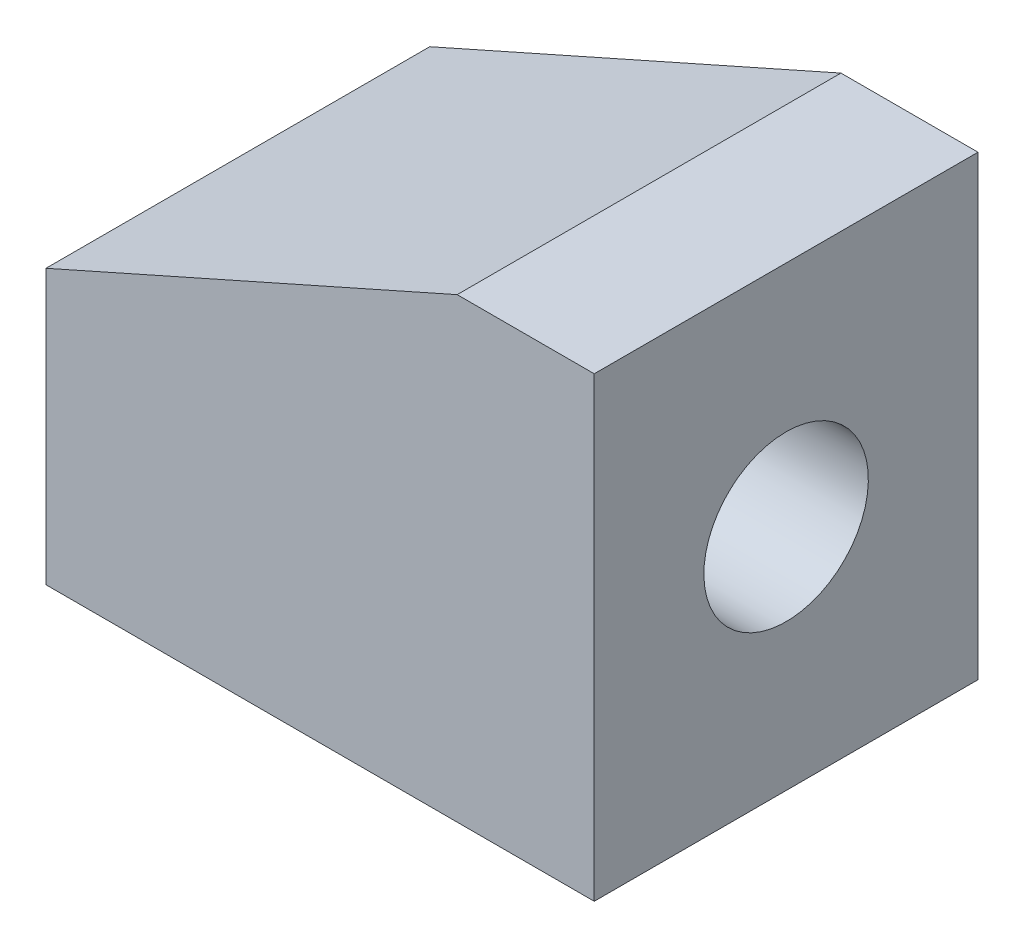
ISO-10303-21;
HEADER;
FILE_DESCRIPTION(('STEP AP214'),'2;1');
FILE_NAME('part.step','',(''),(''),'','','');
FILE_SCHEMA(('AUTOMOTIVE_DESIGN { 1 0 10303 214 1 1 1 1 }'));
ENDSEC;
DATA;
#1=APPLICATION_CONTEXT('core data for automotive mechanical design processes');
#2=APPLICATION_PROTOCOL_DEFINITION('international standard','automotive_design',2000,#1);
#3=PRODUCT_CONTEXT('',#1,'mechanical');
#4=PRODUCT('Part','Part','',(#3));
#5=PRODUCT_RELATED_PRODUCT_CATEGORY('part','',(#4));
#6=PRODUCT_DEFINITION_FORMATION('','',#4);
#7=PRODUCT_DEFINITION_CONTEXT('part definition',#1,'design');
#8=PRODUCT_DEFINITION('design','',#6,#7);
#9=PRODUCT_DEFINITION_SHAPE('','',#8);
#10=(LENGTH_UNIT() NAMED_UNIT(*) SI_UNIT(.MILLI.,.METRE.));
#11=(NAMED_UNIT(*) PLANE_ANGLE_UNIT() SI_UNIT($,.RADIAN.));
#12=(NAMED_UNIT(*) SI_UNIT($,.STERADIAN.) SOLID_ANGLE_UNIT());
#13=UNCERTAINTY_MEASURE_WITH_UNIT(LENGTH_MEASURE(1.E-05),#10,'distance_accuracy_value','');
#14=(GEOMETRIC_REPRESENTATION_CONTEXT(3) GLOBAL_UNCERTAINTY_ASSIGNED_CONTEXT((#13)) GLOBAL_UNIT_ASSIGNED_CONTEXT((#10,
#11,#12)) REPRESENTATION_CONTEXT('',''));
#15=CARTESIAN_POINT('',(0.,0.,0.));
#16=DIRECTION('',(0.,0.,1.));
#17=DIRECTION('',(1.,0.,0.));
#18=AXIS2_PLACEMENT_3D('',#15,#16,#17);
#19=CARTESIAN_POINT('',(-38.2352941176471,12.9411764705882,42.));
#20=DIRECTION('',(1.,0.,0.));
#21=DIRECTION('',(0.,0.,-1.));
#22=AXIS2_PLACEMENT_3D('',#19,#20,#21);
#23=PLANE('',#22);
#24=DIRECTION('',(0.,-1.,0.));
#25=VECTOR('',#24,1.);
#26=CARTESIAN_POINT('',(-38.2352941176471,12.9411764705882,0.));
#27=LINE('',#26,#25);
#28=CARTESIAN_POINT('',(-38.2352941176471,12.9411764705882,0.));
#29=VERTEX_POINT('',#28);
#30=CARTESIAN_POINT('',(-38.2352941176471,-17.0588235294118,0.));
#31=VERTEX_POINT('',#30);
#32=EDGE_CURVE('E118',#29,#31,#27,.T.);
#33=ORIENTED_EDGE('',*,*,#32,.T.);
#34=DIRECTION('',(0.,0.,-1.));
#35=VECTOR('',#34,1.);
#36=CARTESIAN_POINT('',(-38.2352941176471,-17.0588235294118,42.));
#37=LINE('',#36,#35);
#38=CARTESIAN_POINT('',(-38.2352941176471,-17.0588235294118,42.));
#39=VERTEX_POINT('',#38);
#40=EDGE_CURVE('E11',#39,#31,#37,.T.);
#41=ORIENTED_EDGE('',*,*,#40,.F.);
#42=DIRECTION('',(0.,-1.,0.));
#43=VECTOR('',#42,1.);
#44=CARTESIAN_POINT('',(-38.2352941176471,12.9411764705882,42.));
#45=LINE('',#44,#43);
#46=CARTESIAN_POINT('',(-38.2352941176471,12.9411764705882,42.));
#47=VERTEX_POINT('',#46);
#48=EDGE_CURVE('E132',#47,#39,#45,.T.);
#49=ORIENTED_EDGE('',*,*,#48,.F.);
#50=DIRECTION('',(0.,0.,-1.));
#51=VECTOR('',#50,1.);
#52=CARTESIAN_POINT('',(-38.2352941176471,12.9411764705882,42.));
#53=LINE('',#52,#51);
#54=EDGE_CURVE('E114',#47,#29,#53,.T.);
#55=ORIENTED_EDGE('',*,*,#54,.T.);
#56=EDGE_LOOP('',(#33,#41,#49,#55));
#57=FACE_BOUND('',#56,.T.);
#58=ADVANCED_FACE('F39',(#57),#23,.F.);
#59=CARTESIAN_POINT('',(-38.2352941176471,-17.0588235294118,42.));
#60=DIRECTION('',(0.,1.,0.));
#61=DIRECTION('',(0.,0.,1.));
#62=AXIS2_PLACEMENT_3D('',#59,#60,#61);
#63=PLANE('',#62);
#64=DIRECTION('',(1.,0.,0.));
#65=VECTOR('',#64,1.);
#66=CARTESIAN_POINT('',(-38.2352941176471,-17.0588235294118,0.));
#67=LINE('',#66,#65);
#68=CARTESIAN_POINT('',(21.7647058823529,-17.0588235294118,0.));
#69=VERTEX_POINT('',#68);
#70=EDGE_CURVE('E122',#31,#69,#67,.T.);
#71=ORIENTED_EDGE('',*,*,#70,.T.);
#72=DIRECTION('',(0.,0.,-1.));
#73=VECTOR('',#72,1.);
#74=CARTESIAN_POINT('',(21.7647058823529,-17.0588235294118,42.));
#75=LINE('',#74,#73);
#76=CARTESIAN_POINT('',(21.7647058823529,-17.0588235294118,42.));
#77=VERTEX_POINT('',#76);
#78=EDGE_CURVE('E48',#77,#69,#75,.T.);
#79=ORIENTED_EDGE('',*,*,#78,.F.);
#80=DIRECTION('',(1.,0.,0.));
#81=VECTOR('',#80,1.);
#82=CARTESIAN_POINT('',(-38.2352941176471,-17.0588235294118,42.));
#83=LINE('',#82,#81);
#84=EDGE_CURVE('E90',#39,#77,#83,.T.);
#85=ORIENTED_EDGE('',*,*,#84,.F.);
#86=ORIENTED_EDGE('',*,*,#40,.T.);
#87=EDGE_LOOP('',(#71,#79,#85,#86));
#88=FACE_BOUND('',#87,.T.);
#89=ADVANCED_FACE('F154',(#88),#63,.F.);
#90=CARTESIAN_POINT('',(21.7647058823529,-17.0588235294118,42.));
#91=DIRECTION('',(-1.,0.,0.));
#92=DIRECTION('',(0.,-1.,0.));
#93=AXIS2_PLACEMENT_3D('',#90,#91,#92);
#94=PLANE('',#93);
#95=CARTESIAN_POINT('',(21.7647058823529,7.94117647058824,21.));
#96=DIRECTION('',(1.,0.,0.));
#97=DIRECTION('',(0.,1.,0.));
#98=AXIS2_PLACEMENT_3D('',#95,#96,#97);
#99=CIRCLE('',#98,9.);
#100=CARTESIAN_POINT('',(21.7647058823529,16.9411764705882,21.));
#101=VERTEX_POINT('',#100);
#102=EDGE_CURVE('E167',#101,#101,#99,.T.);
#103=ORIENTED_EDGE('',*,*,#102,.F.);
#104=EDGE_LOOP('',(#103));
#105=FACE_BOUND('',#104,.T.);
#106=DIRECTION('',(0.,1.,0.));
#107=VECTOR('',#106,1.);
#108=CARTESIAN_POINT('',(21.7647058823529,-17.0588235294118,0.));
#109=LINE('',#108,#107);
#110=CARTESIAN_POINT('',(21.7647058823529,32.9411764705882,0.));
#111=VERTEX_POINT('',#110);
#112=EDGE_CURVE('E106',#69,#111,#109,.T.);
#113=ORIENTED_EDGE('',*,*,#112,.T.);
#114=DIRECTION('',(0.,0.,-1.));
#115=VECTOR('',#114,1.);
#116=CARTESIAN_POINT('',(21.7647058823529,32.9411764705882,42.));
#117=LINE('',#116,#115);
#118=CARTESIAN_POINT('',(21.7647058823529,32.9411764705882,42.));
#119=VERTEX_POINT('',#118);
#120=EDGE_CURVE('E103',#119,#111,#117,.T.);
#121=ORIENTED_EDGE('',*,*,#120,.F.);
#122=DIRECTION('',(0.,1.,0.));
#123=VECTOR('',#122,1.);
#124=CARTESIAN_POINT('',(21.7647058823529,-17.0588235294118,42.));
#125=LINE('',#124,#123);
#126=EDGE_CURVE('E94',#77,#119,#125,.T.);
#127=ORIENTED_EDGE('',*,*,#126,.F.);
#128=ORIENTED_EDGE('',*,*,#78,.T.);
#129=EDGE_LOOP('',(#113,#121,#127,#128));
#130=FACE_BOUND('',#129,.T.);
#131=ADVANCED_FACE('F104',(#105,#130),#94,.F.);
#132=CARTESIAN_POINT('',(21.7647058823529,32.9411764705882,42.));
#133=DIRECTION('',(0.,-1.,0.));
#134=DIRECTION('',(0.,0.,-1.));
#135=AXIS2_PLACEMENT_3D('',#132,#133,#134);
#136=PLANE('',#135);
#137=DIRECTION('',(-1.,0.,0.));
#138=VECTOR('',#137,1.);
#139=CARTESIAN_POINT('',(21.7647058823529,32.9411764705882,0.));
#140=LINE('',#139,#138);
#141=CARTESIAN_POINT('',(6.76470588235293,32.9411764705882,0.));
#142=VERTEX_POINT('',#141);
#143=EDGE_CURVE('E76',#111,#142,#140,.T.);
#144=ORIENTED_EDGE('',*,*,#143,.T.);
#145=DIRECTION('',(0.,0.,-1.));
#146=VECTOR('',#145,1.);
#147=CARTESIAN_POINT('',(6.76470588235293,32.9411764705882,42.));
#148=LINE('',#147,#146);
#149=CARTESIAN_POINT('',(6.76470588235293,32.9411764705882,42.));
#150=VERTEX_POINT('',#149);
#151=EDGE_CURVE('E108',#150,#142,#148,.T.);
#152=ORIENTED_EDGE('',*,*,#151,.F.);
#153=DIRECTION('',(-1.,0.,0.));
#154=VECTOR('',#153,1.);
#155=CARTESIAN_POINT('',(21.7647058823529,32.9411764705882,42.));
#156=LINE('',#155,#154);
#157=EDGE_CURVE('E98',#119,#150,#156,.T.);
#158=ORIENTED_EDGE('',*,*,#157,.F.);
#159=ORIENTED_EDGE('',*,*,#120,.T.);
#160=EDGE_LOOP('',(#144,#152,#158,#159));
#161=FACE_BOUND('',#160,.T.);
#162=ADVANCED_FACE('F110',(#161),#136,.F.);
#163=CARTESIAN_POINT('',(6.76470588235293,32.9411764705882,42.));
#164=DIRECTION('',(0.406138466053448,-0.913811548620257,0.));
#165=DIRECTION('',(0.913811548620257,0.406138466053448,0.));
#166=AXIS2_PLACEMENT_3D('',#163,#164,#165);
#167=PLANE('',#166);
#168=DIRECTION('',(-0.913811548620257,-0.406138466053448,0.));
#169=VECTOR('',#168,1.);
#170=CARTESIAN_POINT('',(6.76470588235293,32.9411764705882,0.));
#171=LINE('',#170,#169);
#172=EDGE_CURVE('E82',#142,#29,#171,.T.);
#173=ORIENTED_EDGE('',*,*,#172,.T.);
#174=ORIENTED_EDGE('',*,*,#54,.F.);
#175=DIRECTION('',(-0.913811548620257,-0.406138466053448,0.));
#176=VECTOR('',#175,1.);
#177=CARTESIAN_POINT('',(6.76470588235293,32.9411764705882,42.));
#178=LINE('',#177,#176);
#179=EDGE_CURVE('E56',#150,#47,#178,.T.);
#180=ORIENTED_EDGE('',*,*,#179,.F.);
#181=ORIENTED_EDGE('',*,*,#151,.T.);
#182=EDGE_LOOP('',(#173,#174,#180,#181));
#183=FACE_BOUND('',#182,.T.);
#184=ADVANCED_FACE('F143',(#183),#167,.F.);
#185=CARTESIAN_POINT('',(0.,0.,42.));
#186=DIRECTION('',(0.,0.,1.));
#187=DIRECTION('',(1.,0.,0.));
#188=AXIS2_PLACEMENT_3D('',#185,#186,#187);
#189=PLANE('',#188);
#190=ORIENTED_EDGE('',*,*,#48,.T.);
#191=ORIENTED_EDGE('',*,*,#84,.T.);
#192=ORIENTED_EDGE('',*,*,#126,.T.);
#193=ORIENTED_EDGE('',*,*,#157,.T.);
#194=ORIENTED_EDGE('',*,*,#179,.T.);
#195=EDGE_LOOP('',(#190,#191,#192,#193,#194));
#196=FACE_BOUND('',#195,.T.);
#197=ADVANCED_FACE('F96',(#196),#189,.T.);
#198=CARTESIAN_POINT('',(0.,0.,0.));
#199=DIRECTION('',(0.,0.,1.));
#200=DIRECTION('',(1.,0.,0.));
#201=AXIS2_PLACEMENT_3D('',#198,#199,#200);
#202=PLANE('',#201);
#203=ORIENTED_EDGE('',*,*,#32,.F.);
#204=ORIENTED_EDGE('',*,*,#172,.F.);
#205=ORIENTED_EDGE('',*,*,#143,.F.);
#206=ORIENTED_EDGE('',*,*,#112,.F.);
#207=ORIENTED_EDGE('',*,*,#70,.F.);
#208=EDGE_LOOP('',(#203,#204,#205,#206,#207));
#209=FACE_BOUND('',#208,.T.);
#210=ADVANCED_FACE('F139',(#209),#202,.F.);
#211=CARTESIAN_POINT('',(-18.2352941176471,7.94117647058824,21.));
#212=DIRECTION('',(1.,0.,0.));
#213=DIRECTION('',(0.,1.,0.));
#214=AXIS2_PLACEMENT_3D('',#211,#212,#213);
#215=CYLINDRICAL_SURFACE('',#214,9.);
#216=CARTESIAN_POINT('',(-18.2352941176471,7.94117647058824,21.));
#217=DIRECTION('',(1.,0.,0.));
#218=DIRECTION('',(0.,1.,0.));
#219=AXIS2_PLACEMENT_3D('',#216,#217,#218);
#220=CIRCLE('',#219,9.);
#221=CARTESIAN_POINT('',(-18.2352941176471,16.9411764705882,21.));
#222=VERTEX_POINT('',#221);
#223=EDGE_CURVE('E123',#222,#222,#220,.T.);
#224=ORIENTED_EDGE('',*,*,#223,.F.);
#225=EDGE_LOOP('',(#224));
#226=FACE_BOUND('',#225,.T.);
#227=ORIENTED_EDGE('',*,*,#102,.T.);
#228=EDGE_LOOP('',(#227));
#229=FACE_BOUND('',#228,.T.);
#230=ADVANCED_FACE('F181',(#226,#229),#215,.F.);
#231=CARTESIAN_POINT('',(-18.2352941176471,7.94117647058824,21.));
#232=DIRECTION('',(1.,0.,0.));
#233=DIRECTION('',(0.,1.,0.));
#234=AXIS2_PLACEMENT_3D('',#231,#232,#233);
#235=PLANE('',#234);
#236=ORIENTED_EDGE('',*,*,#223,.T.);
#237=EDGE_LOOP('',(#236));
#238=FACE_BOUND('',#237,.T.);
#239=ADVANCED_FACE('F179',(#238),#235,.T.);
#240=CLOSED_SHELL('',(#58,#89,#131,#162,#184,#197,#210,#230,#239));
#241=MANIFOLD_SOLID_BREP('B2',#240);
#242=ADVANCED_BREP_SHAPE_REPRESENTATION('',(#18,#241),#14);
#243=SHAPE_DEFINITION_REPRESENTATION(#9,#242);
ENDSEC;
END-ISO-10303-21;
